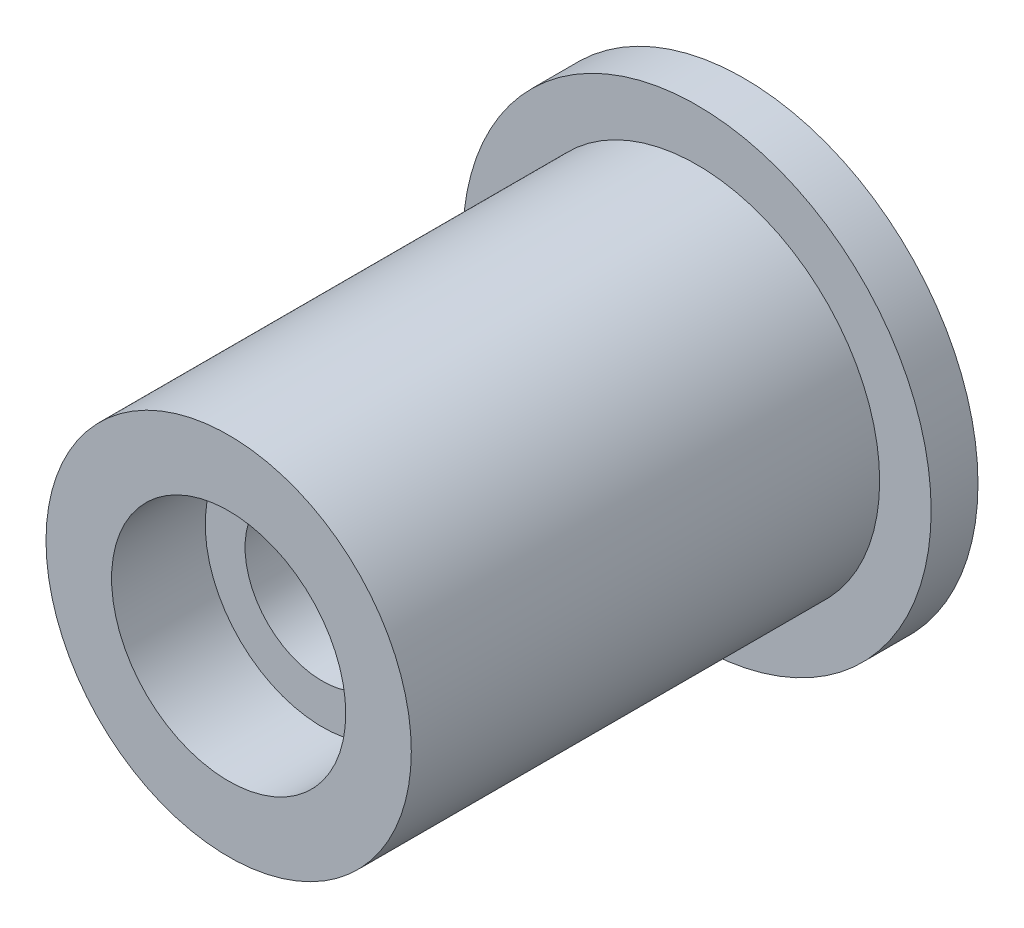
ISO-10303-21;
HEADER;
FILE_DESCRIPTION(('STEP AP214'),'2;1');
FILE_NAME('part.step','',(''),(''),'','','');
FILE_SCHEMA(('AUTOMOTIVE_DESIGN { 1 0 10303 214 1 1 1 1 }'));
ENDSEC;
DATA;
#1=APPLICATION_CONTEXT('core data for automotive mechanical design processes');
#2=APPLICATION_PROTOCOL_DEFINITION('international standard','automotive_design',2000,#1);
#3=PRODUCT_CONTEXT('',#1,'mechanical');
#4=PRODUCT('Part','Part','',(#3));
#5=PRODUCT_RELATED_PRODUCT_CATEGORY('part','',(#4));
#6=PRODUCT_DEFINITION_FORMATION('','',#4);
#7=PRODUCT_DEFINITION_CONTEXT('part definition',#1,'design');
#8=PRODUCT_DEFINITION('design','',#6,#7);
#9=PRODUCT_DEFINITION_SHAPE('','',#8);
#10=(LENGTH_UNIT() NAMED_UNIT(*) SI_UNIT(.MILLI.,.METRE.));
#11=(NAMED_UNIT(*) PLANE_ANGLE_UNIT() SI_UNIT($,.RADIAN.));
#12=(NAMED_UNIT(*) SI_UNIT($,.STERADIAN.) SOLID_ANGLE_UNIT());
#13=UNCERTAINTY_MEASURE_WITH_UNIT(LENGTH_MEASURE(1.E-05),#10,'distance_accuracy_value','');
#14=(GEOMETRIC_REPRESENTATION_CONTEXT(3) GLOBAL_UNCERTAINTY_ASSIGNED_CONTEXT((#13)) GLOBAL_UNIT_ASSIGNED_CONTEXT((#10,
#11,#12)) REPRESENTATION_CONTEXT('',''));
#15=CARTESIAN_POINT('',(0.,0.,0.));
#16=DIRECTION('',(0.,0.,1.));
#17=DIRECTION('',(1.,0.,0.));
#18=AXIS2_PLACEMENT_3D('',#15,#16,#17);
#19=CARTESIAN_POINT('',(0.,0.,-1.));
#20=DIRECTION('',(0.,0.,1.));
#21=DIRECTION('',(1.,0.,0.));
#22=AXIS2_PLACEMENT_3D('',#19,#20,#21);
#23=CYLINDRICAL_SURFACE('',#22,5.);
#24=CARTESIAN_POINT('',(0.,0.,-1.));
#25=DIRECTION('',(0.,0.,1.));
#26=DIRECTION('',(1.,0.,0.));
#27=AXIS2_PLACEMENT_3D('',#24,#25,#26);
#28=CIRCLE('',#27,5.);
#29=CARTESIAN_POINT('',(5.,0.,-1.));
#30=VERTEX_POINT('',#29);
#31=EDGE_CURVE('E61',#30,#30,#28,.T.);
#32=ORIENTED_EDGE('',*,*,#31,.T.);
#33=EDGE_LOOP('',(#32));
#34=FACE_BOUND('',#33,.T.);
#35=CARTESIAN_POINT('',(0.,0.,0.));
#36=DIRECTION('',(0.,0.,1.));
#37=DIRECTION('',(1.,0.,0.));
#38=AXIS2_PLACEMENT_3D('',#35,#36,#37);
#39=CIRCLE('',#38,5.);
#40=CARTESIAN_POINT('',(5.,0.,0.));
#41=VERTEX_POINT('',#40);
#42=EDGE_CURVE('E67',#41,#41,#39,.T.);
#43=ORIENTED_EDGE('',*,*,#42,.F.);
#44=EDGE_LOOP('',(#43));
#45=FACE_BOUND('',#44,.T.);
#46=ADVANCED_FACE('F49',(#34,#45),#23,.T.);
#47=CARTESIAN_POINT('',(0.,0.,-1.));
#48=DIRECTION('',(0.,0.,1.));
#49=DIRECTION('',(1.,0.,0.));
#50=AXIS2_PLACEMENT_3D('',#47,#48,#49);
#51=PLANE('',#50);
#52=CARTESIAN_POINT('',(0.,0.,-1.));
#53=DIRECTION('',(0.,0.,1.));
#54=DIRECTION('',(1.,0.,0.));
#55=AXIS2_PLACEMENT_3D('',#52,#53,#54);
#56=CIRCLE('',#55,1.65);
#57=CARTESIAN_POINT('',(1.65,0.,-1.));
#58=VERTEX_POINT('',#57);
#59=EDGE_CURVE('E73',#58,#58,#56,.T.);
#60=ORIENTED_EDGE('',*,*,#59,.T.);
#61=EDGE_LOOP('',(#60));
#62=FACE_BOUND('',#61,.T.);
#63=ORIENTED_EDGE('',*,*,#31,.F.);
#64=EDGE_LOOP('',(#63));
#65=FACE_BOUND('',#64,.T.);
#66=ADVANCED_FACE('F83',(#62,#65),#51,.F.);
#67=CARTESIAN_POINT('',(0.,0.,0.));
#68=DIRECTION('',(0.,0.,1.));
#69=DIRECTION('',(1.,0.,0.));
#70=AXIS2_PLACEMENT_3D('',#67,#68,#69);
#71=PLANE('',#70);
#72=CARTESIAN_POINT('',(0.,0.,0.));
#73=DIRECTION('',(0.,0.,1.));
#74=DIRECTION('',(1.,0.,0.));
#75=AXIS2_PLACEMENT_3D('',#72,#73,#74);
#76=CIRCLE('',#75,3.9);
#77=CARTESIAN_POINT('',(3.9,0.,0.));
#78=VERTEX_POINT('',#77);
#79=EDGE_CURVE('E56',#78,#78,#76,.T.);
#80=ORIENTED_EDGE('',*,*,#79,.F.);
#81=EDGE_LOOP('',(#80));
#82=FACE_BOUND('',#81,.T.);
#83=ORIENTED_EDGE('',*,*,#42,.T.);
#84=EDGE_LOOP('',(#83));
#85=FACE_BOUND('',#84,.T.);
#86=ADVANCED_FACE('F80',(#82,#85),#71,.T.);
#87=CARTESIAN_POINT('',(0.,0.,-1.));
#88=DIRECTION('',(0.,0.,1.));
#89=DIRECTION('',(1.,0.,0.));
#90=AXIS2_PLACEMENT_3D('',#87,#88,#89);
#91=CYLINDRICAL_SURFACE('',#90,1.65);
#92=ORIENTED_EDGE('',*,*,#59,.F.);
#93=EDGE_LOOP('',(#92));
#94=FACE_BOUND('',#93,.T.);
#95=CARTESIAN_POINT('',(0.,0.,8.));
#96=DIRECTION('',(0.,0.,1.));
#97=DIRECTION('',(1.,0.,0.));
#98=AXIS2_PLACEMENT_3D('',#95,#96,#97);
#99=CIRCLE('',#98,1.65);
#100=CARTESIAN_POINT('',(1.65,0.,8.));
#101=VERTEX_POINT('',#100);
#102=EDGE_CURVE('E120',#101,#101,#99,.T.);
#103=ORIENTED_EDGE('',*,*,#102,.T.);
#104=EDGE_LOOP('',(#103));
#105=FACE_BOUND('',#104,.T.);
#106=ADVANCED_FACE('F95',(#94,#105),#91,.F.);
#107=CARTESIAN_POINT('',(0.,0.,10.));
#108=DIRECTION('',(0.,0.,-1.));
#109=DIRECTION('',(-1.,0.,0.));
#110=AXIS2_PLACEMENT_3D('',#107,#108,#109);
#111=CYLINDRICAL_SURFACE('',#110,2.5);
#112=CARTESIAN_POINT('',(0.,0.,8.));
#113=DIRECTION('',(0.,0.,1.));
#114=DIRECTION('',(1.,0.,0.));
#115=AXIS2_PLACEMENT_3D('',#112,#113,#114);
#116=CIRCLE('',#115,2.5);
#117=CARTESIAN_POINT('',(2.5,0.,8.));
#118=VERTEX_POINT('',#117);
#119=EDGE_CURVE('E11',#118,#118,#116,.T.);
#120=ORIENTED_EDGE('',*,*,#119,.F.);
#121=EDGE_LOOP('',(#120));
#122=FACE_BOUND('',#121,.T.);
#123=CARTESIAN_POINT('',(0.,0.,10.));
#124=DIRECTION('',(0.,0.,1.));
#125=DIRECTION('',(1.,0.,0.));
#126=AXIS2_PLACEMENT_3D('',#123,#124,#125);
#127=CIRCLE('',#126,2.5);
#128=CARTESIAN_POINT('',(2.5,0.,10.));
#129=VERTEX_POINT('',#128);
#130=EDGE_CURVE('E123',#129,#129,#127,.T.);
#131=ORIENTED_EDGE('',*,*,#130,.T.);
#132=EDGE_LOOP('',(#131));
#133=FACE_BOUND('',#132,.T.);
#134=ADVANCED_FACE('F100',(#122,#133),#111,.F.);
#135=CARTESIAN_POINT('',(0.,0.,10.));
#136=DIRECTION('',(0.,0.,-1.));
#137=DIRECTION('',(-1.,0.,0.));
#138=AXIS2_PLACEMENT_3D('',#135,#136,#137);
#139=CYLINDRICAL_SURFACE('',#138,3.9);
#140=CARTESIAN_POINT('',(0.,0.,10.));
#141=DIRECTION('',(0.,0.,1.));
#142=DIRECTION('',(1.,0.,0.));
#143=AXIS2_PLACEMENT_3D('',#140,#141,#142);
#144=CIRCLE('',#143,3.9);
#145=CARTESIAN_POINT('',(3.9,0.,10.));
#146=VERTEX_POINT('',#145);
#147=EDGE_CURVE('E71',#146,#146,#144,.T.);
#148=ORIENTED_EDGE('',*,*,#147,.F.);
#149=EDGE_LOOP('',(#148));
#150=FACE_BOUND('',#149,.T.);
#151=ORIENTED_EDGE('',*,*,#79,.T.);
#152=EDGE_LOOP('',(#151));
#153=FACE_BOUND('',#152,.T.);
#154=ADVANCED_FACE('F104',(#150,#153),#139,.T.);
#155=CARTESIAN_POINT('',(0.,0.,10.));
#156=DIRECTION('',(0.,0.,1.));
#157=DIRECTION('',(1.,0.,0.));
#158=AXIS2_PLACEMENT_3D('',#155,#156,#157);
#159=PLANE('',#158);
#160=ORIENTED_EDGE('',*,*,#130,.F.);
#161=EDGE_LOOP('',(#160));
#162=FACE_BOUND('',#161,.T.);
#163=ORIENTED_EDGE('',*,*,#147,.T.);
#164=EDGE_LOOP('',(#163));
#165=FACE_BOUND('',#164,.T.);
#166=ADVANCED_FACE('F108',(#162,#165),#159,.T.);
#167=CARTESIAN_POINT('',(0.,0.,8.));
#168=DIRECTION('',(0.,0.,1.));
#169=DIRECTION('',(1.,0.,0.));
#170=AXIS2_PLACEMENT_3D('',#167,#168,#169);
#171=PLANE('',#170);
#172=ORIENTED_EDGE('',*,*,#102,.F.);
#173=EDGE_LOOP('',(#172));
#174=FACE_BOUND('',#173,.T.);
#175=ORIENTED_EDGE('',*,*,#119,.T.);
#176=EDGE_LOOP('',(#175));
#177=FACE_BOUND('',#176,.T.);
#178=ADVANCED_FACE('F112',(#174,#177),#171,.T.);
#179=CLOSED_SHELL('',(#46,#66,#86,#106,#134,#154,#166,#178));
#180=MANIFOLD_SOLID_BREP('B2',#179);
#181=ADVANCED_BREP_SHAPE_REPRESENTATION('',(#18,#180),#14);
#182=SHAPE_DEFINITION_REPRESENTATION(#9,#181);
ENDSEC;
END-ISO-10303-21;
